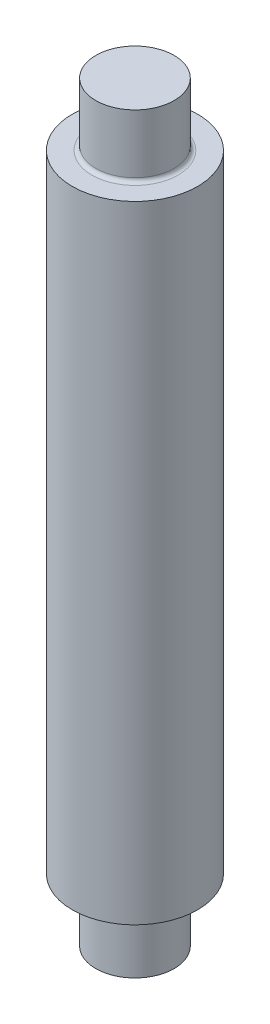
ISO-10303-21;
HEADER;
FILE_DESCRIPTION(('STEP AP214'),'2;1');
FILE_NAME('part.step','',(''),(''),'','','');
FILE_SCHEMA(('AUTOMOTIVE_DESIGN { 1 0 10303 214 1 1 1 1 }'));
ENDSEC;
DATA;
#1=APPLICATION_CONTEXT('core data for automotive mechanical design processes');
#2=APPLICATION_PROTOCOL_DEFINITION('international standard','automotive_design',2000,#1);
#3=PRODUCT_CONTEXT('',#1,'mechanical');
#4=PRODUCT('Part','Part','',(#3));
#5=PRODUCT_RELATED_PRODUCT_CATEGORY('part','',(#4));
#6=PRODUCT_DEFINITION_FORMATION('','',#4);
#7=PRODUCT_DEFINITION_CONTEXT('part definition',#1,'design');
#8=PRODUCT_DEFINITION('design','',#6,#7);
#9=PRODUCT_DEFINITION_SHAPE('','',#8);
#10=(LENGTH_UNIT() NAMED_UNIT(*) SI_UNIT(.MILLI.,.METRE.));
#11=(NAMED_UNIT(*) PLANE_ANGLE_UNIT() SI_UNIT($,.RADIAN.));
#12=(NAMED_UNIT(*) SI_UNIT($,.STERADIAN.) SOLID_ANGLE_UNIT());
#13=UNCERTAINTY_MEASURE_WITH_UNIT(LENGTH_MEASURE(1.E-05),#10,'distance_accuracy_value','');
#14=(GEOMETRIC_REPRESENTATION_CONTEXT(3) GLOBAL_UNCERTAINTY_ASSIGNED_CONTEXT((#13)) GLOBAL_UNIT_ASSIGNED_CONTEXT((#10,
#11,#12)) REPRESENTATION_CONTEXT('',''));
#15=CARTESIAN_POINT('',(0.,0.,0.));
#16=DIRECTION('',(0.,0.,1.));
#17=DIRECTION('',(1.,0.,0.));
#18=AXIS2_PLACEMENT_3D('',#15,#16,#17);
#19=CARTESIAN_POINT('',(7.93749999999997,-76.2,0.));
#20=DIRECTION('',(0.,-1.,0.));
#21=DIRECTION('',(0.,0.,-1.));
#22=AXIS2_PLACEMENT_3D('',#19,#20,#21);
#23=PLANE('',#22);
#24=CARTESIAN_POINT('',(0.,-76.2,0.));
#25=DIRECTION('',(0.,1.,0.));
#26=DIRECTION('',(0.,0.,1.));
#27=AXIS2_PLACEMENT_3D('',#24,#25,#26);
#28=CIRCLE('',#27,7.93749999999994);
#29=CARTESIAN_POINT('',(0.,-76.2,7.93749999999994));
#30=VERTEX_POINT('',#29);
#31=EDGE_CURVE('E10',#30,#30,#28,.T.);
#32=ORIENTED_EDGE('',*,*,#31,.F.);
#33=EDGE_LOOP('',(#32));
#34=FACE_BOUND('',#33,.T.);
#35=ADVANCED_FACE('F34',(#34),#23,.T.);
#36=CARTESIAN_POINT('',(0.,76.2,0.));
#37=DIRECTION('',(0.,1.,0.));
#38=DIRECTION('',(0.,0.,1.));
#39=AXIS2_PLACEMENT_3D('',#36,#37,#38);
#40=CYLINDRICAL_SURFACE('',#39,7.93749999999995);
#41=ORIENTED_EDGE('',*,*,#31,.T.);
#42=EDGE_LOOP('',(#41));
#43=FACE_BOUND('',#42,.T.);
#44=CARTESIAN_POINT('',(0.,-64.29375,0.));
#45=DIRECTION('',(0.,1.,0.));
#46=DIRECTION('',(0.,0.,1.));
#47=AXIS2_PLACEMENT_3D('',#44,#45,#46);
#48=CIRCLE('',#47,7.93749999999995);
#49=CARTESIAN_POINT('',(0.,-64.29375,7.93749999999995));
#50=VERTEX_POINT('',#49);
#51=EDGE_CURVE('E40',#50,#50,#48,.T.);
#52=ORIENTED_EDGE('',*,*,#51,.F.);
#53=EDGE_LOOP('',(#52));
#54=FACE_BOUND('',#53,.T.);
#55=ADVANCED_FACE('F84',(#43,#54),#40,.T.);
#56=CARTESIAN_POINT('',(0.,-64.29375,0.));
#57=DIRECTION('',(0.,1.,0.));
#58=DIRECTION('',(0.,0.,1.));
#59=AXIS2_PLACEMENT_3D('',#56,#57,#58);
#60=TOROIDAL_SURFACE('',#59,8.73124999999994,0.793749999999997);
#61=ORIENTED_EDGE('',*,*,#51,.T.);
#62=EDGE_LOOP('',(#61));
#63=FACE_BOUND('',#62,.T.);
#64=CARTESIAN_POINT('',(0.,-63.5,0.));
#65=DIRECTION('',(0.,1.,0.));
#66=DIRECTION('',(0.,0.,1.));
#67=AXIS2_PLACEMENT_3D('',#64,#65,#66);
#68=CIRCLE('',#67,8.73124999999994);
#69=CARTESIAN_POINT('',(0.,-63.5,8.73124999999994));
#70=VERTEX_POINT('',#69);
#71=EDGE_CURVE('E44',#70,#70,#68,.T.);
#72=ORIENTED_EDGE('',*,*,#71,.F.);
#73=EDGE_LOOP('',(#72));
#74=FACE_BOUND('',#73,.T.);
#75=ADVANCED_FACE('F89',(#63,#74),#60,.F.);
#76=CARTESIAN_POINT('',(12.7,-63.5,0.));
#77=DIRECTION('',(0.,-1.,0.));
#78=DIRECTION('',(0.,0.,-1.));
#79=AXIS2_PLACEMENT_3D('',#76,#77,#78);
#80=PLANE('',#79);
#81=ORIENTED_EDGE('',*,*,#71,.T.);
#82=EDGE_LOOP('',(#81));
#83=FACE_BOUND('',#82,.T.);
#84=CARTESIAN_POINT('',(0.,-63.5,0.));
#85=DIRECTION('',(0.,1.,0.));
#86=DIRECTION('',(0.,0.,1.));
#87=AXIS2_PLACEMENT_3D('',#84,#85,#86);
#88=CIRCLE('',#87,12.6999999999999);
#89=CARTESIAN_POINT('',(0.,-63.5,12.6999999999999));
#90=VERTEX_POINT('',#89);
#91=EDGE_CURVE('E48',#90,#90,#88,.T.);
#92=ORIENTED_EDGE('',*,*,#91,.F.);
#93=EDGE_LOOP('',(#92));
#94=FACE_BOUND('',#93,.T.);
#95=ADVANCED_FACE('F93',(#83,#94),#80,.T.);
#96=CARTESIAN_POINT('',(0.,76.2,0.));
#97=DIRECTION('',(0.,1.,0.));
#98=DIRECTION('',(0.,0.,1.));
#99=AXIS2_PLACEMENT_3D('',#96,#97,#98);
#100=CYLINDRICAL_SURFACE('',#99,12.6999999999999);
#101=ORIENTED_EDGE('',*,*,#91,.T.);
#102=EDGE_LOOP('',(#101));
#103=FACE_BOUND('',#102,.T.);
#104=CARTESIAN_POINT('',(0.,63.5,0.));
#105=DIRECTION('',(0.,1.,0.));
#106=DIRECTION('',(0.,0.,1.));
#107=AXIS2_PLACEMENT_3D('',#104,#105,#106);
#108=CIRCLE('',#107,12.6999999999999);
#109=CARTESIAN_POINT('',(0.,63.5,12.6999999999999));
#110=VERTEX_POINT('',#109);
#111=EDGE_CURVE('E53',#110,#110,#108,.T.);
#112=ORIENTED_EDGE('',*,*,#111,.F.);
#113=EDGE_LOOP('',(#112));
#114=FACE_BOUND('',#113,.T.);
#115=ADVANCED_FACE('F99',(#103,#114),#100,.T.);
#116=CARTESIAN_POINT('',(8.73124999999997,63.5,0.));
#117=DIRECTION('',(0.,1.,0.));
#118=DIRECTION('',(0.,0.,1.));
#119=AXIS2_PLACEMENT_3D('',#116,#117,#118);
#120=PLANE('',#119);
#121=ORIENTED_EDGE('',*,*,#111,.T.);
#122=EDGE_LOOP('',(#121));
#123=FACE_BOUND('',#122,.T.);
#124=CARTESIAN_POINT('',(0.,63.5,0.));
#125=DIRECTION('',(0.,1.,0.));
#126=DIRECTION('',(0.,0.,1.));
#127=AXIS2_PLACEMENT_3D('',#124,#125,#126);
#128=CIRCLE('',#127,8.73124999999994);
#129=CARTESIAN_POINT('',(0.,63.5,8.73124999999994));
#130=VERTEX_POINT('',#129);
#131=EDGE_CURVE('E57',#130,#130,#128,.T.);
#132=ORIENTED_EDGE('',*,*,#131,.F.);
#133=EDGE_LOOP('',(#132));
#134=FACE_BOUND('',#133,.T.);
#135=ADVANCED_FACE('F80',(#123,#134),#120,.T.);
#136=CARTESIAN_POINT('',(0.,64.29375,0.));
#137=DIRECTION('',(0.,1.,0.));
#138=DIRECTION('',(0.,0.,1.));
#139=AXIS2_PLACEMENT_3D('',#136,#137,#138);
#140=TOROIDAL_SURFACE('',#139,8.73124999999994,0.793749999999997);
#141=ORIENTED_EDGE('',*,*,#131,.T.);
#142=EDGE_LOOP('',(#141));
#143=FACE_BOUND('',#142,.T.);
#144=CARTESIAN_POINT('',(0.,64.29375,0.));
#145=DIRECTION('',(0.,1.,0.));
#146=DIRECTION('',(0.,0.,1.));
#147=AXIS2_PLACEMENT_3D('',#144,#145,#146);
#148=CIRCLE('',#147,7.93749999999995);
#149=CARTESIAN_POINT('',(0.,64.29375,7.93749999999995));
#150=VERTEX_POINT('',#149);
#151=EDGE_CURVE('E61',#150,#150,#148,.T.);
#152=ORIENTED_EDGE('',*,*,#151,.F.);
#153=EDGE_LOOP('',(#152));
#154=FACE_BOUND('',#153,.T.);
#155=ADVANCED_FACE('F72',(#143,#154),#140,.F.);
#156=CARTESIAN_POINT('',(0.,76.2,0.));
#157=DIRECTION('',(0.,1.,0.));
#158=DIRECTION('',(0.,0.,1.));
#159=AXIS2_PLACEMENT_3D('',#156,#157,#158);
#160=CYLINDRICAL_SURFACE('',#159,7.93749999999994);
#161=ORIENTED_EDGE('',*,*,#151,.T.);
#162=EDGE_LOOP('',(#161));
#163=FACE_BOUND('',#162,.T.);
#164=CARTESIAN_POINT('',(0.,76.2,0.));
#165=DIRECTION('',(0.,1.,0.));
#166=DIRECTION('',(0.,0.,1.));
#167=AXIS2_PLACEMENT_3D('',#164,#165,#166);
#168=CIRCLE('',#167,7.93749999999994);
#169=CARTESIAN_POINT('',(0.,76.2,7.93749999999994));
#170=VERTEX_POINT('',#169);
#171=EDGE_CURVE('E64',#170,#170,#168,.T.);
#172=ORIENTED_EDGE('',*,*,#171,.F.);
#173=EDGE_LOOP('',(#172));
#174=FACE_BOUND('',#173,.T.);
#175=ADVANCED_FACE('F70',(#163,#174),#160,.T.);
#176=CARTESIAN_POINT('',(0.,76.2,0.));
#177=DIRECTION('',(0.,1.,0.));
#178=DIRECTION('',(0.,0.,1.));
#179=AXIS2_PLACEMENT_3D('',#176,#177,#178);
#180=PLANE('',#179);
#181=ORIENTED_EDGE('',*,*,#171,.T.);
#182=EDGE_LOOP('',(#181));
#183=FACE_BOUND('',#182,.T.);
#184=ADVANCED_FACE('F68',(#183),#180,.T.);
#185=CLOSED_SHELL('',(#35,#55,#75,#95,#115,#135,#155,#175,#184));
#186=MANIFOLD_SOLID_BREP('B2',#185);
#187=ADVANCED_BREP_SHAPE_REPRESENTATION('',(#18,#186),#14);
#188=SHAPE_DEFINITION_REPRESENTATION(#9,#187);
ENDSEC;
END-ISO-10303-21;
